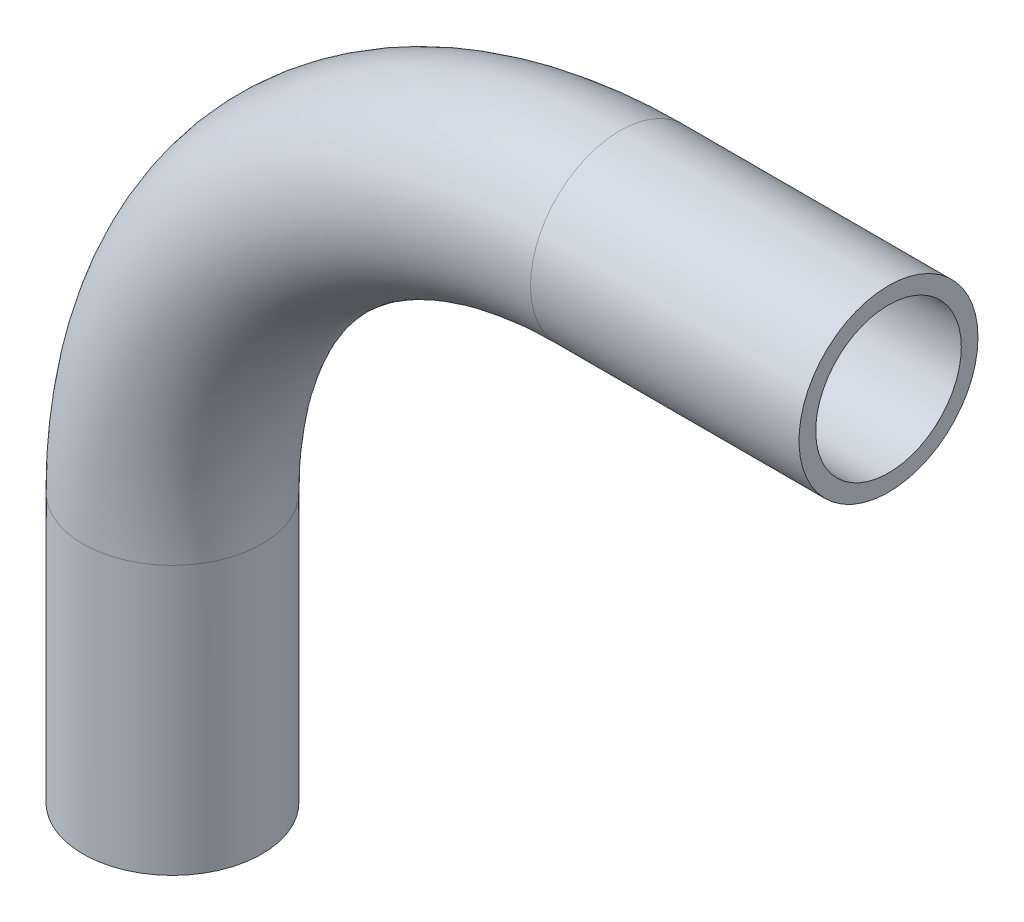
ISO-10303-21;
HEADER;
FILE_DESCRIPTION(('STEP AP214'),'2;1');
FILE_NAME('part.step','',(''),(''),'','','');
FILE_SCHEMA(('AUTOMOTIVE_DESIGN { 1 0 10303 214 1 1 1 1 }'));
ENDSEC;
DATA;
#1=APPLICATION_CONTEXT('core data for automotive mechanical design processes');
#2=APPLICATION_PROTOCOL_DEFINITION('international standard','automotive_design',2000,#1);
#3=PRODUCT_CONTEXT('',#1,'mechanical');
#4=PRODUCT('Part','Part','',(#3));
#5=PRODUCT_RELATED_PRODUCT_CATEGORY('part','',(#4));
#6=PRODUCT_DEFINITION_FORMATION('','',#4);
#7=PRODUCT_DEFINITION_CONTEXT('part definition',#1,'design');
#8=PRODUCT_DEFINITION('design','',#6,#7);
#9=PRODUCT_DEFINITION_SHAPE('','',#8);
#10=(LENGTH_UNIT() NAMED_UNIT(*) SI_UNIT(.MILLI.,.METRE.));
#11=(NAMED_UNIT(*) PLANE_ANGLE_UNIT() SI_UNIT($,.RADIAN.));
#12=(NAMED_UNIT(*) SI_UNIT($,.STERADIAN.) SOLID_ANGLE_UNIT());
#13=UNCERTAINTY_MEASURE_WITH_UNIT(LENGTH_MEASURE(1.E-05),#10,'distance_accuracy_value','');
#14=(GEOMETRIC_REPRESENTATION_CONTEXT(3) GLOBAL_UNCERTAINTY_ASSIGNED_CONTEXT((#13)) GLOBAL_UNIT_ASSIGNED_CONTEXT((#10,
#11,#12)) REPRESENTATION_CONTEXT('',''));
#15=CARTESIAN_POINT('',(0.,0.,0.));
#16=DIRECTION('',(0.,0.,1.));
#17=DIRECTION('',(1.,0.,0.));
#18=AXIS2_PLACEMENT_3D('',#15,#16,#17);
#19=CARTESIAN_POINT('',(-4.55715444344157E-13,-38.1,0.));
#20=DIRECTION('',(0.,1.,0.));
#21=DIRECTION('',(-1.,0.,0.));
#22=AXIS2_PLACEMENT_3D('',#19,#20,#21);
#23=CYLINDRICAL_SURFACE('',#22,4.7625);
#24=CARTESIAN_POINT('',(-2.84494650060196E-13,-23.8125000000001,0.));
#25=DIRECTION('',(0.,1.,0.));
#26=DIRECTION('',(0.,0.,-1.));
#27=AXIS2_PLACEMENT_3D('',#24,#25,#26);
#28=CIRCLE('',#27,4.7625);
#29=CARTESIAN_POINT('',(-4.76250000000028,-23.8125,0.));
#30=VERTEX_POINT('',#29);
#31=EDGE_CURVE('E78',#30,#30,#28,.T.);
#32=ORIENTED_EDGE('',*,*,#31,.F.);
#33=EDGE_LOOP('',(#32));
#34=FACE_BOUND('',#33,.T.);
#35=CARTESIAN_POINT('',(-4.55715444344157E-13,-38.1,0.));
#36=DIRECTION('',(0.,1.,0.));
#37=DIRECTION('',(0.,0.,-1.));
#38=AXIS2_PLACEMENT_3D('',#35,#36,#37);
#39=CIRCLE('',#38,4.7625);
#40=CARTESIAN_POINT('',(-4.55715444344157E-13,-38.1,-4.7625));
#41=VERTEX_POINT('',#40);
#42=EDGE_CURVE('E47',#41,#41,#39,.T.);
#43=ORIENTED_EDGE('',*,*,#42,.T.);
#44=EDGE_LOOP('',(#43));
#45=FACE_BOUND('',#44,.T.);
#46=ADVANCED_FACE('F32',(#34,#45),#23,.T.);
#47=CARTESIAN_POINT('',(23.8124999999997,-23.8125000000004,0.));
#48=DIRECTION('',(0.,0.,-1.));
#49=DIRECTION('',(-1.,0.,0.));
#50=AXIS2_PLACEMENT_3D('',#47,#48,#49);
#51=TOROIDAL_SURFACE('',#50,23.8125,4.7625);
#52=CARTESIAN_POINT('',(23.8125000000001,-3.78193516536796E-13,0.));
#53=DIRECTION('',(1.,0.,0.));
#54=DIRECTION('',(0.,0.,-1.));
#55=AXIS2_PLACEMENT_3D('',#52,#53,#54);
#56=CIRCLE('',#55,4.7625);
#57=CARTESIAN_POINT('',(23.8125000000002,4.76249999999963,0.));
#58=VERTEX_POINT('',#57);
#59=EDGE_CURVE('E36',#58,#58,#56,.T.);
#60=CARTESIAN_POINT('',(23.8124999999997,-23.8125000000004,0.));
#61=DIRECTION('',(0.,0.,-1.));
#62=DIRECTION('',(-1.,0.,0.));
#63=AXIS2_PLACEMENT_3D('',#60,#61,#62);
#64=CIRCLE('',#63,28.575);
#65=EDGE_CURVE('',#30,#58,#64,.T.);
#66=ORIENTED_EDGE('',*,*,#31,.T.);
#67=ORIENTED_EDGE('',*,*,#59,.F.);
#68=ORIENTED_EDGE('',*,*,#65,.T.);
#69=ORIENTED_EDGE('',*,*,#65,.F.);
#70=EDGE_LOOP('',(#66,#68,#67,#69));
#71=FACE_BOUND('',#70,.T.);
#72=ADVANCED_FACE('F86',(#71),#51,.T.);
#73=CARTESIAN_POINT('',(23.8125000000001,-3.78169717762944E-13,0.));
#74=DIRECTION('',(1.,0.,0.));
#75=DIRECTION('',(0.,1.,0.));
#76=AXIS2_PLACEMENT_3D('',#73,#74,#75);
#77=CYLINDRICAL_SURFACE('',#76,4.7625);
#78=CARTESIAN_POINT('',(38.1,-6.02738596268335E-13,0.));
#79=DIRECTION('',(1.,0.,0.));
#80=DIRECTION('',(0.,0.,-1.));
#81=AXIS2_PLACEMENT_3D('',#78,#79,#80);
#82=CIRCLE('',#81,4.7625);
#83=CARTESIAN_POINT('',(38.1,-6.02738596268335E-13,-4.7625));
#84=VERTEX_POINT('',#83);
#85=EDGE_CURVE('E52',#84,#84,#82,.T.);
#86=ORIENTED_EDGE('',*,*,#85,.F.);
#87=EDGE_LOOP('',(#86));
#88=FACE_BOUND('',#87,.T.);
#89=ORIENTED_EDGE('',*,*,#59,.T.);
#90=EDGE_LOOP('',(#89));
#91=FACE_BOUND('',#90,.T.);
#92=ADVANCED_FACE('F34',(#88,#91),#77,.T.);
#93=CARTESIAN_POINT('',(-4.55715444344157E-13,-38.1,0.));
#94=DIRECTION('',(0.,1.,0.));
#95=DIRECTION('',(0.,0.,-1.));
#96=AXIS2_PLACEMENT_3D('',#93,#94,#95);
#97=PLANE('',#96);
#98=CARTESIAN_POINT('',(-4.55715444344157E-13,-38.1,0.));
#99=DIRECTION('',(0.,1.,0.));
#100=DIRECTION('',(0.,0.,-1.));
#101=AXIS2_PLACEMENT_3D('',#98,#99,#100);
#102=CIRCLE('',#101,3.8735);
#103=CARTESIAN_POINT('',(-4.55715444344157E-13,-38.1,-3.8735));
#104=VERTEX_POINT('',#103);
#105=EDGE_CURVE('E73',#104,#104,#102,.F.);
#106=ORIENTED_EDGE('',*,*,#105,.F.);
#107=EDGE_LOOP('',(#106));
#108=FACE_BOUND('',#107,.T.);
#109=ORIENTED_EDGE('',*,*,#42,.F.);
#110=EDGE_LOOP('',(#109));
#111=FACE_BOUND('',#110,.T.);
#112=ADVANCED_FACE('F92',(#108,#111),#97,.F.);
#113=CARTESIAN_POINT('',(38.1,-6.02738596268335E-13,0.));
#114=DIRECTION('',(1.,0.,0.));
#115=DIRECTION('',(0.,0.,-1.));
#116=AXIS2_PLACEMENT_3D('',#113,#114,#115);
#117=PLANE('',#116);
#118=CARTESIAN_POINT('',(38.1,-6.02738596268335E-13,0.));
#119=DIRECTION('',(1.,0.,0.));
#120=DIRECTION('',(0.,0.,-1.));
#121=AXIS2_PLACEMENT_3D('',#118,#119,#120);
#122=CIRCLE('',#121,3.8735);
#123=CARTESIAN_POINT('',(38.1,-6.02738596268335E-13,-3.8735));
#124=VERTEX_POINT('',#123);
#125=EDGE_CURVE('E11',#124,#124,#122,.F.);
#126=ORIENTED_EDGE('',*,*,#125,.T.);
#127=EDGE_LOOP('',(#126));
#128=FACE_BOUND('',#127,.T.);
#129=ORIENTED_EDGE('',*,*,#85,.T.);
#130=EDGE_LOOP('',(#129));
#131=FACE_BOUND('',#130,.T.);
#132=ADVANCED_FACE('F59',(#128,#131),#117,.T.);
#133=CARTESIAN_POINT('',(-4.55715444344157E-13,-38.1,0.));
#134=DIRECTION('',(0.,1.,0.));
#135=DIRECTION('',(-1.,0.,0.));
#136=AXIS2_PLACEMENT_3D('',#133,#134,#135);
#137=CYLINDRICAL_SURFACE('',#136,3.8735);
#138=CARTESIAN_POINT('',(-2.84494650060196E-13,-23.8125000000001,0.));
#139=DIRECTION('',(0.,1.,0.));
#140=DIRECTION('',(0.,0.,-1.));
#141=AXIS2_PLACEMENT_3D('',#138,#139,#140);
#142=CIRCLE('',#141,3.8735);
#143=CARTESIAN_POINT('',(-3.87350000000028,-23.8125,0.));
#144=VERTEX_POINT('',#143);
#145=EDGE_CURVE('E70',#144,#144,#142,.F.);
#146=ORIENTED_EDGE('',*,*,#145,.F.);
#147=EDGE_LOOP('',(#146));
#148=FACE_BOUND('',#147,.T.);
#149=ORIENTED_EDGE('',*,*,#105,.T.);
#150=EDGE_LOOP('',(#149));
#151=FACE_BOUND('',#150,.T.);
#152=ADVANCED_FACE('F100',(#148,#151),#137,.F.);
#153=CARTESIAN_POINT('',(23.8124999999997,-23.8125000000004,0.));
#154=DIRECTION('',(0.,0.,-1.));
#155=DIRECTION('',(-1.,0.,0.));
#156=AXIS2_PLACEMENT_3D('',#153,#154,#155);
#157=TOROIDAL_SURFACE('',#156,23.8125,3.8735);
#158=CARTESIAN_POINT('',(23.8125000000001,-3.78193516536796E-13,0.));
#159=DIRECTION('',(1.,0.,0.));
#160=DIRECTION('',(0.,0.,-1.));
#161=AXIS2_PLACEMENT_3D('',#158,#159,#160);
#162=CIRCLE('',#161,3.8735);
#163=CARTESIAN_POINT('',(23.8125000000001,3.87349999999963,0.));
#164=VERTEX_POINT('',#163);
#165=EDGE_CURVE('E41',#164,#164,#162,.F.);
#166=CARTESIAN_POINT('',(23.8124999999997,-23.8125000000004,0.));
#167=DIRECTION('',(0.,0.,-1.));
#168=DIRECTION('',(-1.,0.,0.));
#169=AXIS2_PLACEMENT_3D('',#166,#167,#168);
#170=CIRCLE('',#169,27.686);
#171=EDGE_CURVE('',#144,#164,#170,.T.);
#172=ORIENTED_EDGE('',*,*,#145,.T.);
#173=ORIENTED_EDGE('',*,*,#165,.F.);
#174=ORIENTED_EDGE('',*,*,#171,.T.);
#175=ORIENTED_EDGE('',*,*,#171,.F.);
#176=EDGE_LOOP('',(#172,#174,#173,#175));
#177=FACE_BOUND('',#176,.T.);
#178=ADVANCED_FACE('F65',(#177),#157,.F.);
#179=CARTESIAN_POINT('',(23.8125000000001,-3.78169717762944E-13,0.));
#180=DIRECTION('',(1.,0.,0.));
#181=DIRECTION('',(0.,1.,0.));
#182=AXIS2_PLACEMENT_3D('',#179,#180,#181);
#183=CYLINDRICAL_SURFACE('',#182,3.8735);
#184=ORIENTED_EDGE('',*,*,#125,.F.);
#185=EDGE_LOOP('',(#184));
#186=FACE_BOUND('',#185,.T.);
#187=ORIENTED_EDGE('',*,*,#165,.T.);
#188=EDGE_LOOP('',(#187));
#189=FACE_BOUND('',#188,.T.);
#190=ADVANCED_FACE('F62',(#186,#189),#183,.F.);
#191=CLOSED_SHELL('',(#46,#72,#92,#112,#132,#152,#178,#190));
#192=MANIFOLD_SOLID_BREP('B2',#191);
#193=ADVANCED_BREP_SHAPE_REPRESENTATION('',(#18,#192),#14);
#194=SHAPE_DEFINITION_REPRESENTATION(#9,#193);
ENDSEC;
END-ISO-10303-21;
